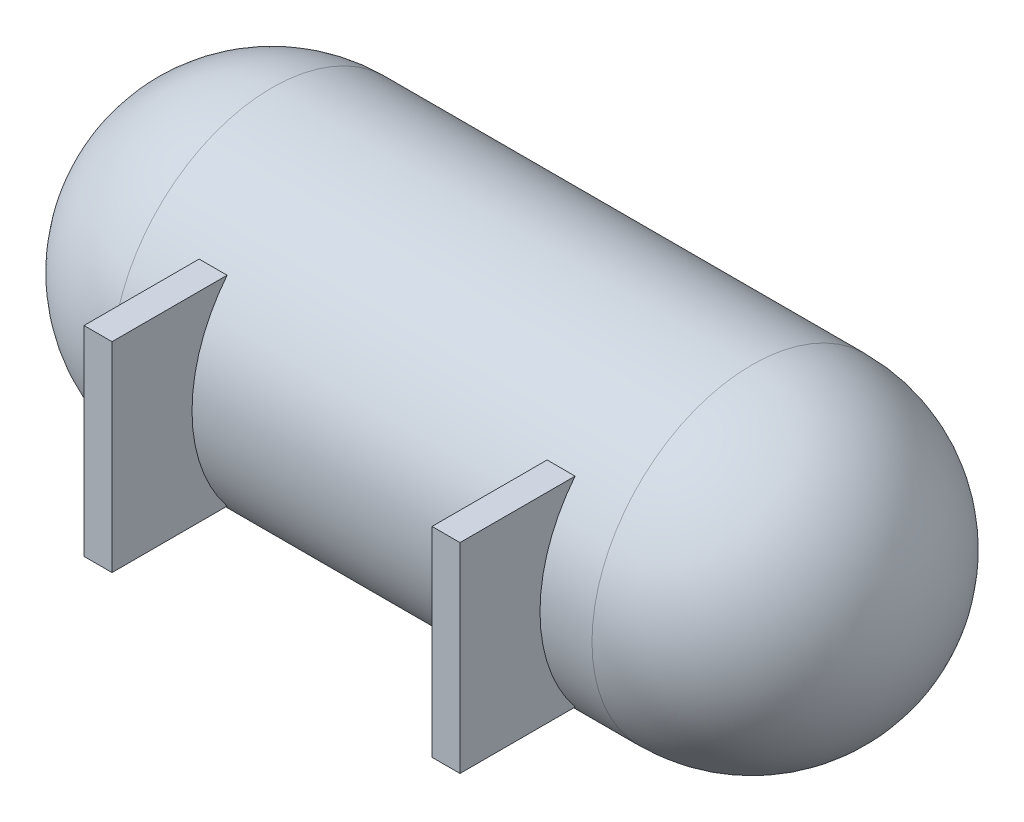
ISO-10303-21;
HEADER;
FILE_DESCRIPTION(('STEP AP214'),'2;1');
FILE_NAME('part.step','',(''),(''),'','','');
FILE_SCHEMA(('AUTOMOTIVE_DESIGN { 1 0 10303 214 1 1 1 1 }'));
ENDSEC;
DATA;
#1=APPLICATION_CONTEXT('core data for automotive mechanical design processes');
#2=APPLICATION_PROTOCOL_DEFINITION('international standard','automotive_design',2000,#1);
#3=PRODUCT_CONTEXT('',#1,'mechanical');
#4=PRODUCT('Part','Part','',(#3));
#5=PRODUCT_RELATED_PRODUCT_CATEGORY('part','',(#4));
#6=PRODUCT_DEFINITION_FORMATION('','',#4);
#7=PRODUCT_DEFINITION_CONTEXT('part definition',#1,'design');
#8=PRODUCT_DEFINITION('design','',#6,#7);
#9=PRODUCT_DEFINITION_SHAPE('','',#8);
#10=(LENGTH_UNIT() NAMED_UNIT(*) SI_UNIT(.MILLI.,.METRE.));
#11=(NAMED_UNIT(*) PLANE_ANGLE_UNIT() SI_UNIT($,.RADIAN.));
#12=(NAMED_UNIT(*) SI_UNIT($,.STERADIAN.) SOLID_ANGLE_UNIT());
#13=UNCERTAINTY_MEASURE_WITH_UNIT(LENGTH_MEASURE(1.E-05),#10,'distance_accuracy_value','');
#14=(GEOMETRIC_REPRESENTATION_CONTEXT(3) GLOBAL_UNCERTAINTY_ASSIGNED_CONTEXT((#13)) GLOBAL_UNIT_ASSIGNED_CONTEXT((#10,
#11,#12)) REPRESENTATION_CONTEXT('',''));
#15=CARTESIAN_POINT('',(0.,0.,0.));
#16=DIRECTION('',(0.,0.,1.));
#17=DIRECTION('',(1.,0.,0.));
#18=AXIS2_PLACEMENT_3D('',#15,#16,#17);
#19=CARTESIAN_POINT('',(200.,0.,0.));
#20=DIRECTION('',(-1.,0.,0.));
#21=DIRECTION('',(0.,1.,0.));
#22=AXIS2_PLACEMENT_3D('',#19,#20,#21);
#23=SPHERICAL_SURFACE('',#22,200.);
#24=CARTESIAN_POINT('',(200.,0.,0.));
#25=DIRECTION('',(-1.,0.,0.));
#26=DIRECTION('',(0.,0.,1.));
#27=AXIS2_PLACEMENT_3D('',#24,#25,#26);
#28=CIRCLE('',#27,200.);
#29=CARTESIAN_POINT('',(200.,0.,200.));
#30=VERTEX_POINT('',#29);
#31=EDGE_CURVE('E142',#30,#30,#28,.T.);
#32=ORIENTED_EDGE('',*,*,#31,.T.);
#33=EDGE_LOOP('',(#32));
#34=FACE_BOUND('',#33,.T.);
#35=ADVANCED_FACE('F40',(#34),#23,.T.);
#36=CARTESIAN_POINT('',(800.,0.,0.));
#37=DIRECTION('',(-1.,0.,0.));
#38=DIRECTION('',(0.,1.,0.));
#39=AXIS2_PLACEMENT_3D('',#36,#37,#38);
#40=SPHERICAL_SURFACE('',#39,200.);
#41=CARTESIAN_POINT('',(800.,0.,0.));
#42=DIRECTION('',(-1.,0.,0.));
#43=DIRECTION('',(0.,0.,1.));
#44=AXIS2_PLACEMENT_3D('',#41,#42,#43);
#45=CIRCLE('',#44,200.);
#46=CARTESIAN_POINT('',(800.,0.,200.));
#47=VERTEX_POINT('',#46);
#48=EDGE_CURVE('E167',#47,#47,#45,.T.);
#49=ORIENTED_EDGE('',*,*,#48,.F.);
#50=EDGE_LOOP('',(#49));
#51=FACE_BOUND('',#50,.T.);
#52=ADVANCED_FACE('F189',(#51),#40,.T.);
#53=CARTESIAN_POINT('',(0.,0.,0.));
#54=DIRECTION('',(-1.,0.,0.));
#55=DIRECTION('',(0.,0.,1.));
#56=AXIS2_PLACEMENT_3D('',#53,#54,#55);
#57=CYLINDRICAL_SURFACE('',#56,200.);
#58=DIRECTION('',(-1.,0.,0.));
#59=VECTOR('',#58,1.);
#60=CARTESIAN_POINT('',(0.,-125.,156.12494995996));
#61=LINE('',#60,#59);
#62=CARTESIAN_POINT('',(265.,-125.,156.12494995996));
#63=VERTEX_POINT('',#62);
#64=CARTESIAN_POINT('',(300.,-125.,156.12494995996));
#65=VERTEX_POINT('',#64);
#66=EDGE_CURVE('E117',#63,#65,#61,.F.);
#67=ORIENTED_EDGE('',*,*,#66,.F.);
#68=CARTESIAN_POINT('',(265.,0.,0.));
#69=DIRECTION('',(-1.,0.,0.));
#70=DIRECTION('',(0.,-1.,0.));
#71=AXIS2_PLACEMENT_3D('',#68,#69,#70);
#72=CIRCLE('',#71,200.);
#73=CARTESIAN_POINT('',(265.,125.,156.12494995996));
#74=VERTEX_POINT('',#73);
#75=EDGE_CURVE('E129',#74,#63,#72,.F.);
#76=ORIENTED_EDGE('',*,*,#75,.F.);
#77=DIRECTION('',(-1.,0.,0.));
#78=VECTOR('',#77,1.);
#79=CARTESIAN_POINT('',(0.,125.,156.12494995996));
#80=LINE('',#79,#78);
#81=CARTESIAN_POINT('',(300.,125.,156.12494995996));
#82=VERTEX_POINT('',#81);
#83=EDGE_CURVE('E110',#82,#74,#80,.T.);
#84=ORIENTED_EDGE('',*,*,#83,.F.);
#85=CARTESIAN_POINT('',(300.,0.,0.));
#86=DIRECTION('',(1.,0.,0.));
#87=DIRECTION('',(0.,0.,-1.));
#88=AXIS2_PLACEMENT_3D('',#85,#86,#87);
#89=CIRCLE('',#88,200.);
#90=EDGE_CURVE('E118',#65,#82,#89,.F.);
#91=ORIENTED_EDGE('',*,*,#90,.F.);
#92=EDGE_LOOP('',(#67,#76,#84,#91));
#93=FACE_BOUND('',#92,.T.);
#94=DIRECTION('',(-1.,0.,0.));
#95=VECTOR('',#94,1.);
#96=CARTESIAN_POINT('',(0.,125.,156.12494995996));
#97=LINE('',#96,#95);
#98=CARTESIAN_POINT('',(735.,125.,156.12494995996));
#99=VERTEX_POINT('',#98);
#100=CARTESIAN_POINT('',(700.,125.,156.12494995996));
#101=VERTEX_POINT('',#100);
#102=EDGE_CURVE('E135',#99,#101,#97,.T.);
#103=ORIENTED_EDGE('',*,*,#102,.F.);
#104=CARTESIAN_POINT('',(735.,0.,0.));
#105=DIRECTION('',(1.,0.,0.));
#106=DIRECTION('',(0.,1.,0.));
#107=AXIS2_PLACEMENT_3D('',#104,#105,#106);
#108=CIRCLE('',#107,200.);
#109=CARTESIAN_POINT('',(735.,-125.,156.12494995996));
#110=VERTEX_POINT('',#109);
#111=EDGE_CURVE('E138',#110,#99,#108,.F.);
#112=ORIENTED_EDGE('',*,*,#111,.F.);
#113=DIRECTION('',(-1.,0.,0.));
#114=VECTOR('',#113,1.);
#115=CARTESIAN_POINT('',(0.,-125.,156.12494995996));
#116=LINE('',#115,#114);
#117=CARTESIAN_POINT('',(700.,-125.,156.12494995996));
#118=VERTEX_POINT('',#117);
#119=EDGE_CURVE('E140',#118,#110,#116,.F.);
#120=ORIENTED_EDGE('',*,*,#119,.F.);
#121=CARTESIAN_POINT('',(700.,0.,0.));
#122=DIRECTION('',(-1.,0.,0.));
#123=DIRECTION('',(0.,0.,1.));
#124=AXIS2_PLACEMENT_3D('',#121,#122,#123);
#125=CIRCLE('',#124,200.);
#126=EDGE_CURVE('E63',#101,#118,#125,.F.);
#127=ORIENTED_EDGE('',*,*,#126,.F.);
#128=EDGE_LOOP('',(#103,#112,#120,#127));
#129=FACE_BOUND('',#128,.T.);
#130=ORIENTED_EDGE('',*,*,#31,.F.);
#131=EDGE_LOOP('',(#130));
#132=FACE_BOUND('',#131,.T.);
#133=ORIENTED_EDGE('',*,*,#48,.T.);
#134=EDGE_LOOP('',(#133));
#135=FACE_BOUND('',#134,.T.);
#136=ADVANCED_FACE('F127',(#93,#129,#132,#135),#57,.T.);
#137=CARTESIAN_POINT('',(0.,0.,300.));
#138=DIRECTION('',(0.,0.,1.));
#139=DIRECTION('',(1.,0.,0.));
#140=AXIS2_PLACEMENT_3D('',#137,#138,#139);
#141=PLANE('',#140);
#142=DIRECTION('',(1.,0.,0.));
#143=VECTOR('',#142,1.);
#144=CARTESIAN_POINT('',(700.,-125.,300.));
#145=LINE('',#144,#143);
#146=CARTESIAN_POINT('',(700.,-125.,300.));
#147=VERTEX_POINT('',#146);
#148=CARTESIAN_POINT('',(735.,-125.,300.));
#149=VERTEX_POINT('',#148);
#150=EDGE_CURVE('E143',#147,#149,#145,.T.);
#151=ORIENTED_EDGE('',*,*,#150,.T.);
#152=DIRECTION('',(0.,1.,0.));
#153=VECTOR('',#152,1.);
#154=CARTESIAN_POINT('',(735.,-125.,300.));
#155=LINE('',#154,#153);
#156=CARTESIAN_POINT('',(735.,125.,300.));
#157=VERTEX_POINT('',#156);
#158=EDGE_CURVE('E146',#149,#157,#155,.T.);
#159=ORIENTED_EDGE('',*,*,#158,.T.);
#160=DIRECTION('',(-1.,0.,0.));
#161=VECTOR('',#160,1.);
#162=CARTESIAN_POINT('',(735.,125.,300.));
#163=LINE('',#162,#161);
#164=CARTESIAN_POINT('',(700.,125.,300.));
#165=VERTEX_POINT('',#164);
#166=EDGE_CURVE('E149',#157,#165,#163,.T.);
#167=ORIENTED_EDGE('',*,*,#166,.T.);
#168=DIRECTION('',(0.,-1.,0.));
#169=VECTOR('',#168,1.);
#170=CARTESIAN_POINT('',(700.,125.,300.));
#171=LINE('',#170,#169);
#172=EDGE_CURVE('E152',#165,#147,#171,.T.);
#173=ORIENTED_EDGE('',*,*,#172,.T.);
#174=EDGE_LOOP('',(#151,#159,#167,#173));
#175=FACE_BOUND('',#174,.T.);
#176=ADVANCED_FACE('F195',(#175),#141,.T.);
#177=CARTESIAN_POINT('',(735.,-125.,-200.001));
#178=DIRECTION('',(1.,0.,0.));
#179=DIRECTION('',(0.,1.,0.));
#180=AXIS2_PLACEMENT_3D('',#177,#178,#179);
#181=PLANE('',#180);
#182=DIRECTION('',(0.,0.,1.));
#183=VECTOR('',#182,1.);
#184=CARTESIAN_POINT('',(735.,-125.,-200.001));
#185=LINE('',#184,#183);
#186=EDGE_CURVE('E155',#110,#149,#185,.T.);
#187=ORIENTED_EDGE('',*,*,#186,.F.);
#188=ORIENTED_EDGE('',*,*,#111,.T.);
#189=DIRECTION('',(0.,0.,1.));
#190=VECTOR('',#189,1.);
#191=CARTESIAN_POINT('',(735.,125.,-200.001));
#192=LINE('',#191,#190);
#193=EDGE_CURVE('E160',#99,#157,#192,.T.);
#194=ORIENTED_EDGE('',*,*,#193,.T.);
#195=ORIENTED_EDGE('',*,*,#158,.F.);
#196=EDGE_LOOP('',(#187,#188,#194,#195));
#197=FACE_BOUND('',#196,.T.);
#198=ADVANCED_FACE('F202',(#197),#181,.T.);
#199=CARTESIAN_POINT('',(735.,125.,-200.001));
#200=DIRECTION('',(0.,1.,0.));
#201=DIRECTION('',(0.,0.,1.));
#202=AXIS2_PLACEMENT_3D('',#199,#200,#201);
#203=PLANE('',#202);
#204=ORIENTED_EDGE('',*,*,#193,.F.);
#205=ORIENTED_EDGE('',*,*,#102,.T.);
#206=DIRECTION('',(0.,0.,1.));
#207=VECTOR('',#206,1.);
#208=CARTESIAN_POINT('',(700.,125.,-200.001));
#209=LINE('',#208,#207);
#210=EDGE_CURVE('E158',#101,#165,#209,.T.);
#211=ORIENTED_EDGE('',*,*,#210,.T.);
#212=ORIENTED_EDGE('',*,*,#166,.F.);
#213=EDGE_LOOP('',(#204,#205,#211,#212));
#214=FACE_BOUND('',#213,.T.);
#215=ADVANCED_FACE('F205',(#214),#203,.T.);
#216=CARTESIAN_POINT('',(700.,125.,-200.001));
#217=DIRECTION('',(-1.,0.,0.));
#218=DIRECTION('',(0.,0.,1.));
#219=AXIS2_PLACEMENT_3D('',#216,#217,#218);
#220=PLANE('',#219);
#221=ORIENTED_EDGE('',*,*,#210,.F.);
#222=ORIENTED_EDGE('',*,*,#126,.T.);
#223=DIRECTION('',(0.,0.,1.));
#224=VECTOR('',#223,1.);
#225=CARTESIAN_POINT('',(700.,-125.,-200.001));
#226=LINE('',#225,#224);
#227=EDGE_CURVE('E156',#118,#147,#226,.T.);
#228=ORIENTED_EDGE('',*,*,#227,.T.);
#229=ORIENTED_EDGE('',*,*,#172,.F.);
#230=EDGE_LOOP('',(#221,#222,#228,#229));
#231=FACE_BOUND('',#230,.T.);
#232=ADVANCED_FACE('F200',(#231),#220,.T.);
#233=CARTESIAN_POINT('',(700.,-125.,-200.001));
#234=DIRECTION('',(0.,-1.,0.));
#235=DIRECTION('',(0.,0.,-1.));
#236=AXIS2_PLACEMENT_3D('',#233,#234,#235);
#237=PLANE('',#236);
#238=ORIENTED_EDGE('',*,*,#227,.F.);
#239=ORIENTED_EDGE('',*,*,#119,.T.);
#240=ORIENTED_EDGE('',*,*,#186,.T.);
#241=ORIENTED_EDGE('',*,*,#150,.F.);
#242=EDGE_LOOP('',(#238,#239,#240,#241));
#243=FACE_BOUND('',#242,.T.);
#244=ADVANCED_FACE('F196',(#243),#237,.T.);
#245=CARTESIAN_POINT('',(265.,-125.,-200.001));
#246=DIRECTION('',(-1.,0.,0.));
#247=DIRECTION('',(0.,-1.,0.));
#248=AXIS2_PLACEMENT_3D('',#245,#246,#247);
#249=PLANE('',#248);
#250=DIRECTION('',(0.,0.,1.));
#251=VECTOR('',#250,1.);
#252=CARTESIAN_POINT('',(265.,125.,-200.001));
#253=LINE('',#252,#251);
#254=CARTESIAN_POINT('',(265.,125.,300.));
#255=VERTEX_POINT('',#254);
#256=EDGE_CURVE('E125',#74,#255,#253,.T.);
#257=ORIENTED_EDGE('',*,*,#256,.F.);
#258=ORIENTED_EDGE('',*,*,#75,.T.);
#259=DIRECTION('',(0.,0.,1.));
#260=VECTOR('',#259,1.);
#261=CARTESIAN_POINT('',(265.,-125.,-200.001));
#262=LINE('',#261,#260);
#263=CARTESIAN_POINT('',(265.,-125.,300.));
#264=VERTEX_POINT('',#263);
#265=EDGE_CURVE('E55',#63,#264,#262,.T.);
#266=ORIENTED_EDGE('',*,*,#265,.T.);
#267=DIRECTION('',(0.,-1.,0.));
#268=VECTOR('',#267,1.);
#269=CARTESIAN_POINT('',(265.,-125.,300.));
#270=LINE('',#269,#268);
#271=EDGE_CURVE('E332',#255,#264,#270,.T.);
#272=ORIENTED_EDGE('',*,*,#271,.F.);
#273=EDGE_LOOP('',(#257,#258,#266,#272));
#274=FACE_BOUND('',#273,.T.);
#275=ADVANCED_FACE('F199',(#274),#249,.T.);
#276=CARTESIAN_POINT('',(265.,125.,-200.001));
#277=DIRECTION('',(0.,1.,0.));
#278=DIRECTION('',(0.,0.,1.));
#279=AXIS2_PLACEMENT_3D('',#276,#277,#278);
#280=PLANE('',#279);
#281=DIRECTION('',(0.,0.,1.));
#282=VECTOR('',#281,1.);
#283=CARTESIAN_POINT('',(300.,125.,-200.001));
#284=LINE('',#283,#282);
#285=CARTESIAN_POINT('',(300.,125.,300.));
#286=VERTEX_POINT('',#285);
#287=EDGE_CURVE('E106',#82,#286,#284,.T.);
#288=ORIENTED_EDGE('',*,*,#287,.F.);
#289=ORIENTED_EDGE('',*,*,#83,.T.);
#290=ORIENTED_EDGE('',*,*,#256,.T.);
#291=DIRECTION('',(-1.,0.,0.));
#292=VECTOR('',#291,1.);
#293=CARTESIAN_POINT('',(265.,125.,300.));
#294=LINE('',#293,#292);
#295=EDGE_CURVE('E113',#286,#255,#294,.T.);
#296=ORIENTED_EDGE('',*,*,#295,.F.);
#297=EDGE_LOOP('',(#288,#289,#290,#296));
#298=FACE_BOUND('',#297,.T.);
#299=ADVANCED_FACE('F108',(#298),#280,.T.);
#300=CARTESIAN_POINT('',(300.,125.,-200.001));
#301=DIRECTION('',(1.,0.,0.));
#302=DIRECTION('',(0.,0.,-1.));
#303=AXIS2_PLACEMENT_3D('',#300,#301,#302);
#304=PLANE('',#303);
#305=DIRECTION('',(0.,0.,1.));
#306=VECTOR('',#305,1.);
#307=CARTESIAN_POINT('',(300.,-125.,-200.001));
#308=LINE('',#307,#306);
#309=CARTESIAN_POINT('',(300.,-125.,300.));
#310=VERTEX_POINT('',#309);
#311=EDGE_CURVE('E122',#65,#310,#308,.T.);
#312=ORIENTED_EDGE('',*,*,#311,.F.);
#313=ORIENTED_EDGE('',*,*,#90,.T.);
#314=ORIENTED_EDGE('',*,*,#287,.T.);
#315=DIRECTION('',(0.,1.,0.));
#316=VECTOR('',#315,1.);
#317=CARTESIAN_POINT('',(300.,125.,300.));
#318=LINE('',#317,#316);
#319=EDGE_CURVE('E335',#310,#286,#318,.T.);
#320=ORIENTED_EDGE('',*,*,#319,.F.);
#321=EDGE_LOOP('',(#312,#313,#314,#320));
#322=FACE_BOUND('',#321,.T.);
#323=ADVANCED_FACE('F121',(#322),#304,.T.);
#324=CARTESIAN_POINT('',(300.,-125.,-200.001));
#325=DIRECTION('',(0.,-1.,0.));
#326=DIRECTION('',(0.,0.,-1.));
#327=AXIS2_PLACEMENT_3D('',#324,#325,#326);
#328=PLANE('',#327);
#329=ORIENTED_EDGE('',*,*,#265,.F.);
#330=ORIENTED_EDGE('',*,*,#66,.T.);
#331=ORIENTED_EDGE('',*,*,#311,.T.);
#332=DIRECTION('',(1.,0.,0.));
#333=VECTOR('',#332,1.);
#334=CARTESIAN_POINT('',(300.,-125.,300.));
#335=LINE('',#334,#333);
#336=EDGE_CURVE('E333',#264,#310,#335,.T.);
#337=ORIENTED_EDGE('',*,*,#336,.F.);
#338=EDGE_LOOP('',(#329,#330,#331,#337));
#339=FACE_BOUND('',#338,.T.);
#340=ADVANCED_FACE('F215',(#339),#328,.T.);
#341=CARTESIAN_POINT('',(0.,0.,300.));
#342=DIRECTION('',(0.,0.,-1.));
#343=DIRECTION('',(-1.,0.,0.));
#344=AXIS2_PLACEMENT_3D('',#341,#342,#343);
#345=PLANE('',#344);
#346=ORIENTED_EDGE('',*,*,#271,.T.);
#347=ORIENTED_EDGE('',*,*,#336,.T.);
#348=ORIENTED_EDGE('',*,*,#319,.T.);
#349=ORIENTED_EDGE('',*,*,#295,.T.);
#350=EDGE_LOOP('',(#346,#347,#348,#349));
#351=FACE_BOUND('',#350,.T.);
#352=ADVANCED_FACE('F218',(#351),#345,.F.);
#353=CLOSED_SHELL('',(#35,#52,#136,#176,#198,#215,#232,#244,#275,#299,#323,#340,#352));
#354=CARTESIAN_POINT('',(200.,0.,0.));
#355=DIRECTION('',(-1.,0.,0.));
#356=DIRECTION('',(0.,1.,0.));
#357=AXIS2_PLACEMENT_3D('',#354,#355,#356);
#358=SPHERICAL_SURFACE('',#357,190.);
#359=CARTESIAN_POINT('',(200.,0.,0.));
#360=DIRECTION('',(-1.,0.,0.));
#361=DIRECTION('',(0.,0.,1.));
#362=AXIS2_PLACEMENT_3D('',#359,#360,#361);
#363=CIRCLE('',#362,190.);
#364=CARTESIAN_POINT('',(200.,0.,190.));
#365=VERTEX_POINT('',#364);
#366=EDGE_CURVE('E11',#365,#365,#363,.T.);
#367=ORIENTED_EDGE('',*,*,#366,.F.);
#368=EDGE_LOOP('',(#367));
#369=FACE_BOUND('',#368,.T.);
#370=ADVANCED_FACE('F177',(#369),#358,.F.);
#371=CARTESIAN_POINT('',(0.,0.,0.));
#372=DIRECTION('',(-1.,0.,0.));
#373=DIRECTION('',(0.,0.,1.));
#374=AXIS2_PLACEMENT_3D('',#371,#372,#373);
#375=CYLINDRICAL_SURFACE('',#374,190.);
#376=CARTESIAN_POINT('',(800.,0.,0.));
#377=DIRECTION('',(-1.,0.,0.));
#378=DIRECTION('',(0.,0.,1.));
#379=AXIS2_PLACEMENT_3D('',#376,#377,#378);
#380=CIRCLE('',#379,190.);
#381=CARTESIAN_POINT('',(800.,0.,190.));
#382=VERTEX_POINT('',#381);
#383=EDGE_CURVE('E48',#382,#382,#380,.T.);
#384=ORIENTED_EDGE('',*,*,#383,.F.);
#385=EDGE_LOOP('',(#384));
#386=FACE_BOUND('',#385,.T.);
#387=ORIENTED_EDGE('',*,*,#366,.T.);
#388=EDGE_LOOP('',(#387));
#389=FACE_BOUND('',#388,.T.);
#390=ADVANCED_FACE('F174',(#386,#389),#375,.F.);
#391=CARTESIAN_POINT('',(800.,0.,0.));
#392=DIRECTION('',(-1.,0.,0.));
#393=DIRECTION('',(0.,1.,0.));
#394=AXIS2_PLACEMENT_3D('',#391,#392,#393);
#395=SPHERICAL_SURFACE('',#394,190.);
#396=ORIENTED_EDGE('',*,*,#383,.T.);
#397=EDGE_LOOP('',(#396));
#398=FACE_BOUND('',#397,.T.);
#399=ADVANCED_FACE('F172',(#398),#395,.F.);
#400=CLOSED_SHELL('',(#370,#390,#399));
#401=ORIENTED_CLOSED_SHELL('',*,#400,.T.);
#402=BREP_WITH_VOIDS('B2',#353,(#401));
#403=ADVANCED_BREP_SHAPE_REPRESENTATION('',(#18,#402),#14);
#404=SHAPE_DEFINITION_REPRESENTATION(#9,#403);
ENDSEC;
END-ISO-10303-21;
